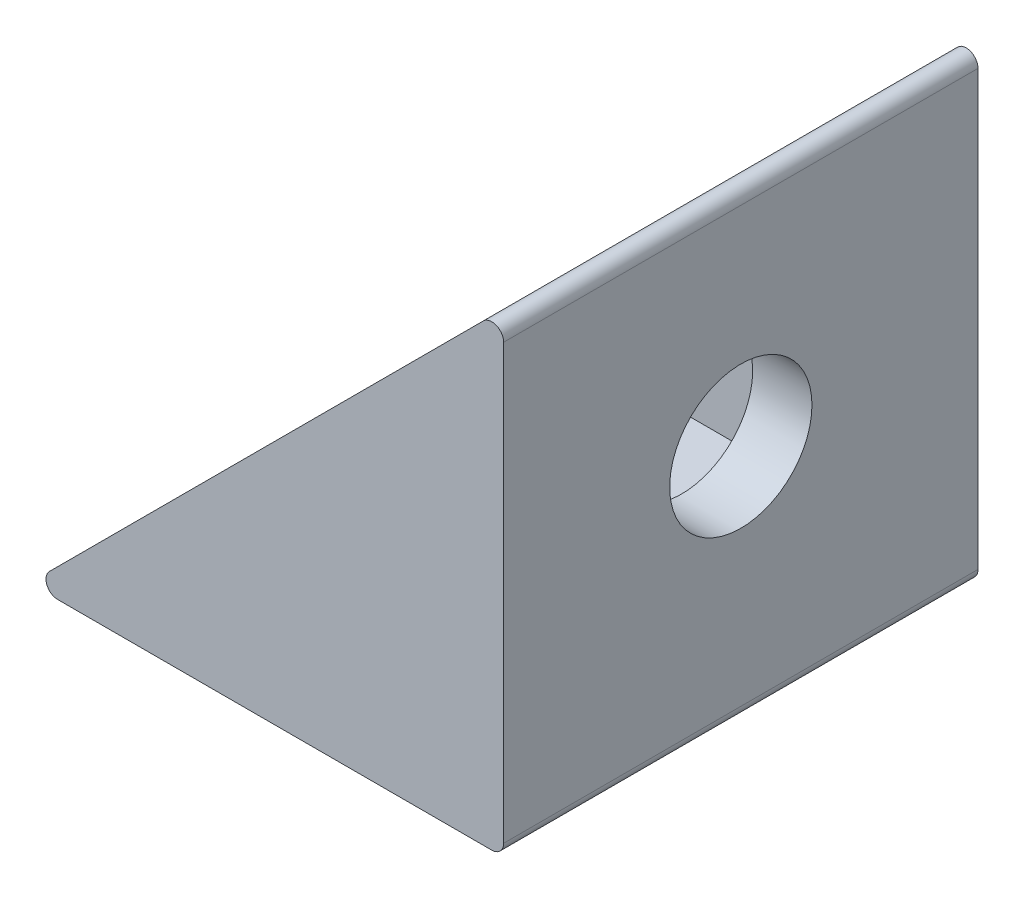
ISO-10303-21;
HEADER;
FILE_DESCRIPTION(('STEP AP214'),'2;1');
FILE_NAME('part.step','',(''),(''),'','','');
FILE_SCHEMA(('AUTOMOTIVE_DESIGN { 1 0 10303 214 1 1 1 1 }'));
ENDSEC;
DATA;
#1=APPLICATION_CONTEXT('core data for automotive mechanical design processes');
#2=APPLICATION_PROTOCOL_DEFINITION('international standard','automotive_design',2000,#1);
#3=PRODUCT_CONTEXT('',#1,'mechanical');
#4=PRODUCT('Part','Part','',(#3));
#5=PRODUCT_RELATED_PRODUCT_CATEGORY('part','',(#4));
#6=PRODUCT_DEFINITION_FORMATION('','',#4);
#7=PRODUCT_DEFINITION_CONTEXT('part definition',#1,'design');
#8=PRODUCT_DEFINITION('design','',#6,#7);
#9=PRODUCT_DEFINITION_SHAPE('','',#8);
#10=(LENGTH_UNIT() NAMED_UNIT(*) SI_UNIT(.MILLI.,.METRE.));
#11=(NAMED_UNIT(*) PLANE_ANGLE_UNIT() SI_UNIT($,.RADIAN.));
#12=(NAMED_UNIT(*) SI_UNIT($,.STERADIAN.) SOLID_ANGLE_UNIT());
#13=UNCERTAINTY_MEASURE_WITH_UNIT(LENGTH_MEASURE(1.E-05),#10,'distance_accuracy_value','');
#14=(GEOMETRIC_REPRESENTATION_CONTEXT(3) GLOBAL_UNCERTAINTY_ASSIGNED_CONTEXT((#13)) GLOBAL_UNIT_ASSIGNED_CONTEXT((#10,
#11,#12)) REPRESENTATION_CONTEXT('',''));
#15=CARTESIAN_POINT('',(0.,0.,0.));
#16=DIRECTION('',(0.,0.,1.));
#17=DIRECTION('',(1.,0.,0.));
#18=AXIS2_PLACEMENT_3D('',#15,#16,#17);
#19=CARTESIAN_POINT('',(0.,20.,0.));
#20=DIRECTION('',(0.,-1.,0.));
#21=DIRECTION('',(0.,0.,-1.));
#22=AXIS2_PLACEMENT_3D('',#19,#20,#21);
#23=CYLINDRICAL_SURFACE('',#22,3.);
#24=CARTESIAN_POINT('',(0.,0.,0.));
#25=DIRECTION('',(0.,-1.,0.));
#26=DIRECTION('',(0.,0.,-1.));
#27=AXIS2_PLACEMENT_3D('',#24,#25,#26);
#28=CIRCLE('',#27,3.);
#29=CARTESIAN_POINT('',(0.,0.,-3.));
#30=VERTEX_POINT('',#29);
#31=EDGE_CURVE('E151',#30,#30,#28,.T.);
#32=ORIENTED_EDGE('',*,*,#31,.T.);
#33=EDGE_LOOP('',(#32));
#34=FACE_BOUND('',#33,.T.);
#35=CARTESIAN_POINT('',(0.,2.5,0.));
#36=DIRECTION('',(0.,1.,0.));
#37=DIRECTION('',(0.,0.,1.));
#38=AXIS2_PLACEMENT_3D('',#35,#36,#37);
#39=CIRCLE('',#38,3.);
#40=CARTESIAN_POINT('',(0.,2.5,3.));
#41=VERTEX_POINT('',#40);
#42=EDGE_CURVE('E127',#41,#41,#39,.F.);
#43=ORIENTED_EDGE('',*,*,#42,.F.);
#44=EDGE_LOOP('',(#43));
#45=FACE_BOUND('',#44,.T.);
#46=ADVANCED_FACE('F41',(#34,#45),#23,.F.);
#47=CARTESIAN_POINT('',(10.,20.,-10.));
#48=DIRECTION('',(-1.,0.,0.));
#49=DIRECTION('',(0.,0.,1.));
#50=AXIS2_PLACEMENT_3D('',#47,#48,#49);
#51=PLANE('',#50);
#52=CARTESIAN_POINT('',(10.,10.,0.));
#53=DIRECTION('',(1.,0.,0.));
#54=DIRECTION('',(0.,0.,-1.));
#55=AXIS2_PLACEMENT_3D('',#52,#53,#54);
#56=CIRCLE('',#55,3.);
#57=CARTESIAN_POINT('',(10.,10.,-3.));
#58=VERTEX_POINT('',#57);
#59=EDGE_CURVE('E156',#58,#58,#56,.T.);
#60=ORIENTED_EDGE('',*,*,#59,.F.);
#61=EDGE_LOOP('',(#60));
#62=FACE_BOUND('',#61,.T.);
#63=DIRECTION('',(0.,-1.,0.));
#64=VECTOR('',#63,1.);
#65=CARTESIAN_POINT('',(10.,20.,10.));
#66=LINE('',#65,#64);
#67=CARTESIAN_POINT('',(10.,18.7928932188134,10.));
#68=VERTEX_POINT('',#67);
#69=CARTESIAN_POINT('',(10.,0.5,10.));
#70=VERTEX_POINT('',#69);
#71=EDGE_CURVE('E175',#68,#70,#66,.T.);
#72=ORIENTED_EDGE('',*,*,#71,.T.);
#73=DIRECTION('',(0.,0.,-1.));
#74=VECTOR('',#73,1.);
#75=CARTESIAN_POINT('',(10.,0.5,-10.));
#76=LINE('',#75,#74);
#77=CARTESIAN_POINT('',(10.,0.5,-10.));
#78=VERTEX_POINT('',#77);
#79=EDGE_CURVE('E198',#70,#78,#76,.T.);
#80=ORIENTED_EDGE('',*,*,#79,.T.);
#81=DIRECTION('',(0.,-1.,0.));
#82=VECTOR('',#81,1.);
#83=CARTESIAN_POINT('',(10.,20.,-10.));
#84=LINE('',#83,#82);
#85=CARTESIAN_POINT('',(10.,18.7928932188134,-10.));
#86=VERTEX_POINT('',#85);
#87=EDGE_CURVE('E179',#86,#78,#84,.T.);
#88=ORIENTED_EDGE('',*,*,#87,.F.);
#89=DIRECTION('',(0.,0.,-1.));
#90=VECTOR('',#89,1.);
#91=CARTESIAN_POINT('',(10.,18.7928932188134,-10.));
#92=LINE('',#91,#90);
#93=EDGE_CURVE('E195',#86,#68,#92,.F.);
#94=ORIENTED_EDGE('',*,*,#93,.T.);
#95=EDGE_LOOP('',(#72,#80,#88,#94));
#96=FACE_BOUND('',#95,.T.);
#97=ADVANCED_FACE('F242',(#62,#96),#51,.F.);
#98=CARTESIAN_POINT('',(-10.,20.,-10.));
#99=DIRECTION('',(0.,0.,1.));
#100=DIRECTION('',(1.,0.,0.));
#101=AXIS2_PLACEMENT_3D('',#98,#99,#100);
#102=PLANE('',#101);
#103=ORIENTED_EDGE('',*,*,#87,.T.);
#104=CARTESIAN_POINT('',(9.5,0.5,-10.));
#105=DIRECTION('',(0.,0.,1.));
#106=DIRECTION('',(1.,0.,0.));
#107=AXIS2_PLACEMENT_3D('',#104,#105,#106);
#108=CIRCLE('',#107,0.5);
#109=CARTESIAN_POINT('',(9.5,0.,-10.));
#110=VERTEX_POINT('',#109);
#111=EDGE_CURVE('E208',#78,#110,#108,.F.);
#112=ORIENTED_EDGE('',*,*,#111,.T.);
#113=DIRECTION('',(-1.,0.,0.));
#114=VECTOR('',#113,1.);
#115=CARTESIAN_POINT('',(-10.,0.,-10.));
#116=LINE('',#115,#114);
#117=CARTESIAN_POINT('',(-8.79289321881345,0.,-10.));
#118=VERTEX_POINT('',#117);
#119=EDGE_CURVE('E167',#110,#118,#116,.T.);
#120=ORIENTED_EDGE('',*,*,#119,.T.);
#121=CARTESIAN_POINT('',(-8.79289321881345,0.5,-10.));
#122=DIRECTION('',(0.,0.,1.));
#123=DIRECTION('',(1.,0.,0.));
#124=AXIS2_PLACEMENT_3D('',#121,#122,#123);
#125=CIRCLE('',#124,0.5);
#126=CARTESIAN_POINT('',(-9.14644660940673,0.853553390593275,-10.));
#127=VERTEX_POINT('',#126);
#128=EDGE_CURVE('E202',#118,#127,#125,.F.);
#129=ORIENTED_EDGE('',*,*,#128,.T.);
#130=DIRECTION('',(0.707106781186548,0.707106781186547,0.));
#131=VECTOR('',#130,1.);
#132=CARTESIAN_POINT('',(-10.,0.,-10.));
#133=LINE('',#132,#131);
#134=CARTESIAN_POINT('',(9.14644660940672,19.1464466094067,-10.));
#135=VERTEX_POINT('',#134);
#136=EDGE_CURVE('E160',#127,#135,#133,.T.);
#137=ORIENTED_EDGE('',*,*,#136,.T.);
#138=CARTESIAN_POINT('',(9.5,18.7928932188134,-10.));
#139=DIRECTION('',(0.,0.,1.));
#140=DIRECTION('',(1.,0.,0.));
#141=AXIS2_PLACEMENT_3D('',#138,#139,#140);
#142=CIRCLE('',#141,0.5);
#143=EDGE_CURVE('E205',#135,#86,#142,.F.);
#144=ORIENTED_EDGE('',*,*,#143,.T.);
#145=EDGE_LOOP('',(#103,#112,#120,#129,#137,#144));
#146=FACE_BOUND('',#145,.T.);
#147=ADVANCED_FACE('F237',(#146),#102,.F.);
#148=CARTESIAN_POINT('',(-10.,20.,10.));
#149=DIRECTION('',(0.,0.,-1.));
#150=DIRECTION('',(-1.,0.,0.));
#151=AXIS2_PLACEMENT_3D('',#148,#149,#150);
#152=PLANE('',#151);
#153=DIRECTION('',(1.,0.,0.));
#154=VECTOR('',#153,1.);
#155=CARTESIAN_POINT('',(-10.,0.,10.));
#156=LINE('',#155,#154);
#157=CARTESIAN_POINT('',(-8.79289321881345,0.,10.));
#158=VERTEX_POINT('',#157);
#159=CARTESIAN_POINT('',(9.5,0.,10.));
#160=VERTEX_POINT('',#159);
#161=EDGE_CURVE('E171',#158,#160,#156,.T.);
#162=ORIENTED_EDGE('',*,*,#161,.T.);
#163=CARTESIAN_POINT('',(9.5,0.5,10.));
#164=DIRECTION('',(0.,0.,-1.));
#165=DIRECTION('',(-1.,0.,0.));
#166=AXIS2_PLACEMENT_3D('',#163,#164,#165);
#167=CIRCLE('',#166,0.5);
#168=EDGE_CURVE('E221',#160,#70,#167,.F.);
#169=ORIENTED_EDGE('',*,*,#168,.T.);
#170=ORIENTED_EDGE('',*,*,#71,.F.);
#171=CARTESIAN_POINT('',(9.5,18.7928932188134,10.));
#172=DIRECTION('',(0.,0.,-1.));
#173=DIRECTION('',(-1.,0.,0.));
#174=AXIS2_PLACEMENT_3D('',#171,#172,#173);
#175=CIRCLE('',#174,0.5);
#176=CARTESIAN_POINT('',(9.14644660940673,19.1464466094067,10.));
#177=VERTEX_POINT('',#176);
#178=EDGE_CURVE('E65',#68,#177,#175,.F.);
#179=ORIENTED_EDGE('',*,*,#178,.T.);
#180=DIRECTION('',(-0.707106781186548,-0.707106781186547,0.));
#181=VECTOR('',#180,1.);
#182=CARTESIAN_POINT('',(0.,10.,10.));
#183=LINE('',#182,#181);
#184=CARTESIAN_POINT('',(-9.14644660940673,0.853553390593275,10.));
#185=VERTEX_POINT('',#184);
#186=EDGE_CURVE('E164',#177,#185,#183,.T.);
#187=ORIENTED_EDGE('',*,*,#186,.T.);
#188=CARTESIAN_POINT('',(-8.79289321881345,0.5,10.));
#189=DIRECTION('',(0.,0.,-1.));
#190=DIRECTION('',(-1.,0.,0.));
#191=AXIS2_PLACEMENT_3D('',#188,#189,#190);
#192=CIRCLE('',#191,0.5);
#193=EDGE_CURVE('E57',#185,#158,#192,.F.);
#194=ORIENTED_EDGE('',*,*,#193,.T.);
#195=EDGE_LOOP('',(#162,#169,#170,#179,#187,#194));
#196=FACE_BOUND('',#195,.T.);
#197=ADVANCED_FACE('F229',(#196),#152,.F.);
#198=CARTESIAN_POINT('',(0.,0.,0.));
#199=DIRECTION('',(0.,1.,0.));
#200=DIRECTION('',(0.,0.,1.));
#201=AXIS2_PLACEMENT_3D('',#198,#199,#200);
#202=PLANE('',#201);
#203=ORIENTED_EDGE('',*,*,#31,.F.);
#204=EDGE_LOOP('',(#203));
#205=FACE_BOUND('',#204,.T.);
#206=ORIENTED_EDGE('',*,*,#119,.F.);
#207=DIRECTION('',(0.,0.,-1.));
#208=VECTOR('',#207,1.);
#209=CARTESIAN_POINT('',(9.5,0.,0.));
#210=LINE('',#209,#208);
#211=EDGE_CURVE('E214',#110,#160,#210,.F.);
#212=ORIENTED_EDGE('',*,*,#211,.T.);
#213=ORIENTED_EDGE('',*,*,#161,.F.);
#214=DIRECTION('',(0.,0.,1.));
#215=VECTOR('',#214,1.);
#216=CARTESIAN_POINT('',(-8.79289321881345,0.,0.));
#217=LINE('',#216,#215);
#218=EDGE_CURVE('E211',#158,#118,#217,.F.);
#219=ORIENTED_EDGE('',*,*,#218,.T.);
#220=EDGE_LOOP('',(#206,#212,#213,#219));
#221=FACE_BOUND('',#220,.T.);
#222=ADVANCED_FACE('F234',(#205,#221),#202,.F.);
#223=CARTESIAN_POINT('',(-10.,0.,-10.));
#224=DIRECTION('',(0.707106781186547,-0.707106781186548,0.));
#225=DIRECTION('',(0.707106781186548,0.707106781186547,0.));
#226=AXIS2_PLACEMENT_3D('',#223,#224,#225);
#227=PLANE('',#226);
#228=DIRECTION('',(0.,0.,1.));
#229=VECTOR('',#228,1.);
#230=CARTESIAN_POINT('',(7.5,17.5,-10.));
#231=LINE('',#230,#229);
#232=CARTESIAN_POINT('',(7.5,17.5,-7.5));
#233=VERTEX_POINT('',#232);
#234=CARTESIAN_POINT('',(7.5,17.5,7.5));
#235=VERTEX_POINT('',#234);
#236=EDGE_CURVE('E141',#233,#235,#231,.T.);
#237=ORIENTED_EDGE('',*,*,#236,.T.);
#238=DIRECTION('',(-0.707106781186548,-0.707106781186547,0.));
#239=VECTOR('',#238,1.);
#240=CARTESIAN_POINT('',(-10.,0.,7.5));
#241=LINE('',#240,#239);
#242=CARTESIAN_POINT('',(-7.5,2.5,7.5));
#243=VERTEX_POINT('',#242);
#244=EDGE_CURVE('E191',#235,#243,#241,.T.);
#245=ORIENTED_EDGE('',*,*,#244,.T.);
#246=DIRECTION('',(0.,0.,-1.));
#247=VECTOR('',#246,1.);
#248=CARTESIAN_POINT('',(-7.5,2.5,7.5));
#249=LINE('',#248,#247);
#250=CARTESIAN_POINT('',(-7.5,2.5,-7.5));
#251=VERTEX_POINT('',#250);
#252=EDGE_CURVE('E146',#243,#251,#249,.T.);
#253=ORIENTED_EDGE('',*,*,#252,.T.);
#254=DIRECTION('',(0.707106781186548,0.707106781186547,0.));
#255=VECTOR('',#254,1.);
#256=CARTESIAN_POINT('',(-10.,0.,-7.5));
#257=LINE('',#256,#255);
#258=EDGE_CURVE('E122',#251,#233,#257,.T.);
#259=ORIENTED_EDGE('',*,*,#258,.T.);
#260=EDGE_LOOP('',(#237,#245,#253,#259));
#261=FACE_BOUND('',#260,.T.);
#262=ORIENTED_EDGE('',*,*,#186,.F.);
#263=DIRECTION('',(0.,0.,-1.));
#264=VECTOR('',#263,1.);
#265=CARTESIAN_POINT('',(9.14644660940672,19.1464466094067,-10.));
#266=LINE('',#265,#264);
#267=EDGE_CURVE('E12',#177,#135,#266,.T.);
#268=ORIENTED_EDGE('',*,*,#267,.T.);
#269=ORIENTED_EDGE('',*,*,#136,.F.);
#270=DIRECTION('',(0.,0.,1.));
#271=VECTOR('',#270,1.);
#272=CARTESIAN_POINT('',(-9.14644660940673,0.853553390593274,-10.));
#273=LINE('',#272,#271);
#274=EDGE_CURVE('E50',#127,#185,#273,.T.);
#275=ORIENTED_EDGE('',*,*,#274,.T.);
#276=EDGE_LOOP('',(#262,#268,#269,#275));
#277=FACE_BOUND('',#276,.T.);
#278=ADVANCED_FACE('F226',(#261,#277),#227,.F.);
#279=CARTESIAN_POINT('',(-10.,10.,0.));
#280=DIRECTION('',(1.,0.,0.));
#281=DIRECTION('',(0.,0.,-1.));
#282=AXIS2_PLACEMENT_3D('',#279,#280,#281);
#283=CYLINDRICAL_SURFACE('',#282,3.);
#284=CARTESIAN_POINT('',(7.5,10.,0.));
#285=DIRECTION('',(1.,0.,0.));
#286=DIRECTION('',(0.,0.,-1.));
#287=AXIS2_PLACEMENT_3D('',#284,#285,#286);
#288=CIRCLE('',#287,3.);
#289=CARTESIAN_POINT('',(7.5,10.,-3.));
#290=VERTEX_POINT('',#289);
#291=EDGE_CURVE('E152',#290,#290,#288,.F.);
#292=ORIENTED_EDGE('',*,*,#291,.T.);
#293=EDGE_LOOP('',(#292));
#294=FACE_BOUND('',#293,.T.);
#295=ORIENTED_EDGE('',*,*,#59,.T.);
#296=EDGE_LOOP('',(#295));
#297=FACE_BOUND('',#296,.T.);
#298=ADVANCED_FACE('F265',(#294,#297),#283,.F.);
#299=CARTESIAN_POINT('',(-7.5,-21.2132034355964,7.5));
#300=DIRECTION('',(0.,0.,1.));
#301=DIRECTION('',(1.,0.,0.));
#302=AXIS2_PLACEMENT_3D('',#299,#300,#301);
#303=PLANE('',#302);
#304=DIRECTION('',(0.,1.,0.));
#305=VECTOR('',#304,1.);
#306=CARTESIAN_POINT('',(7.5,-21.2132034355964,7.5));
#307=LINE('',#306,#305);
#308=CARTESIAN_POINT('',(7.5,2.5,7.5));
#309=VERTEX_POINT('',#308);
#310=EDGE_CURVE('E143',#309,#235,#307,.T.);
#311=ORIENTED_EDGE('',*,*,#310,.F.);
#312=DIRECTION('',(-1.,0.,0.));
#313=VECTOR('',#312,1.);
#314=CARTESIAN_POINT('',(-7.5,2.5,7.5));
#315=LINE('',#314,#313);
#316=EDGE_CURVE('E133',#309,#243,#315,.T.);
#317=ORIENTED_EDGE('',*,*,#316,.T.);
#318=ORIENTED_EDGE('',*,*,#244,.F.);
#319=EDGE_LOOP('',(#311,#317,#318));
#320=FACE_BOUND('',#319,.T.);
#321=ADVANCED_FACE('F268',(#320),#303,.F.);
#322=CARTESIAN_POINT('',(-7.5,-21.2132034355964,-7.5));
#323=DIRECTION('',(0.,0.,-1.));
#324=DIRECTION('',(-1.,0.,0.));
#325=AXIS2_PLACEMENT_3D('',#322,#323,#324);
#326=PLANE('',#325);
#327=DIRECTION('',(1.,0.,0.));
#328=VECTOR('',#327,1.);
#329=CARTESIAN_POINT('',(-7.5,2.5,-7.5));
#330=LINE('',#329,#328);
#331=CARTESIAN_POINT('',(7.5,2.5,-7.5));
#332=VERTEX_POINT('',#331);
#333=EDGE_CURVE('E116',#251,#332,#330,.T.);
#334=ORIENTED_EDGE('',*,*,#333,.T.);
#335=DIRECTION('',(0.,1.,0.));
#336=VECTOR('',#335,1.);
#337=CARTESIAN_POINT('',(7.5,-21.2132034355964,-7.5));
#338=LINE('',#337,#336);
#339=EDGE_CURVE('E120',#332,#233,#338,.T.);
#340=ORIENTED_EDGE('',*,*,#339,.T.);
#341=ORIENTED_EDGE('',*,*,#258,.F.);
#342=EDGE_LOOP('',(#334,#340,#341));
#343=FACE_BOUND('',#342,.T.);
#344=ADVANCED_FACE('F118',(#343),#326,.F.);
#345=CARTESIAN_POINT('',(7.5,-21.2132034355964,7.5));
#346=DIRECTION('',(1.,0.,0.));
#347=DIRECTION('',(0.,0.,-1.));
#348=AXIS2_PLACEMENT_3D('',#345,#346,#347);
#349=PLANE('',#348);
#350=ORIENTED_EDGE('',*,*,#291,.F.);
#351=EDGE_LOOP('',(#350));
#352=FACE_BOUND('',#351,.T.);
#353=ORIENTED_EDGE('',*,*,#339,.F.);
#354=DIRECTION('',(0.,0.,1.));
#355=VECTOR('',#354,1.);
#356=CARTESIAN_POINT('',(7.5,2.5,7.5));
#357=LINE('',#356,#355);
#358=EDGE_CURVE('E128',#332,#309,#357,.T.);
#359=ORIENTED_EDGE('',*,*,#358,.T.);
#360=ORIENTED_EDGE('',*,*,#310,.T.);
#361=ORIENTED_EDGE('',*,*,#236,.F.);
#362=EDGE_LOOP('',(#353,#359,#360,#361));
#363=FACE_BOUND('',#362,.T.);
#364=ADVANCED_FACE('F139',(#352,#363),#349,.F.);
#365=CARTESIAN_POINT('',(0.,2.5,0.));
#366=DIRECTION('',(0.,1.,0.));
#367=DIRECTION('',(0.,0.,1.));
#368=AXIS2_PLACEMENT_3D('',#365,#366,#367);
#369=PLANE('',#368);
#370=ORIENTED_EDGE('',*,*,#358,.F.);
#371=ORIENTED_EDGE('',*,*,#333,.F.);
#372=ORIENTED_EDGE('',*,*,#252,.F.);
#373=ORIENTED_EDGE('',*,*,#316,.F.);
#374=EDGE_LOOP('',(#370,#371,#372,#373));
#375=FACE_BOUND('',#374,.T.);
#376=ORIENTED_EDGE('',*,*,#42,.T.);
#377=EDGE_LOOP('',(#376));
#378=FACE_BOUND('',#377,.T.);
#379=ADVANCED_FACE('F131',(#375,#378),#369,.T.);
#380=CARTESIAN_POINT('',(9.5,0.5,-10.));
#381=DIRECTION('',(0.,0.,-1.));
#382=DIRECTION('',(-1.,0.,0.));
#383=AXIS2_PLACEMENT_3D('',#380,#381,#382);
#384=CYLINDRICAL_SURFACE('',#383,0.5);
#385=ORIENTED_EDGE('',*,*,#168,.F.);
#386=ORIENTED_EDGE('',*,*,#211,.F.);
#387=ORIENTED_EDGE('',*,*,#111,.F.);
#388=ORIENTED_EDGE('',*,*,#79,.F.);
#389=EDGE_LOOP('',(#385,#386,#387,#388));
#390=FACE_BOUND('',#389,.T.);
#391=ADVANCED_FACE('F239',(#390),#384,.T.);
#392=CARTESIAN_POINT('',(9.5,18.7928932188134,-10.));
#393=DIRECTION('',(0.,0.,-1.));
#394=DIRECTION('',(-1.,0.,0.));
#395=AXIS2_PLACEMENT_3D('',#392,#393,#394);
#396=CYLINDRICAL_SURFACE('',#395,0.5);
#397=ORIENTED_EDGE('',*,*,#178,.F.);
#398=ORIENTED_EDGE('',*,*,#93,.F.);
#399=ORIENTED_EDGE('',*,*,#143,.F.);
#400=ORIENTED_EDGE('',*,*,#267,.F.);
#401=EDGE_LOOP('',(#397,#398,#399,#400));
#402=FACE_BOUND('',#401,.T.);
#403=ADVANCED_FACE('F246',(#402),#396,.T.);
#404=CARTESIAN_POINT('',(-8.79289321881345,0.5,-10.));
#405=DIRECTION('',(0.,0.,1.));
#406=DIRECTION('',(1.,0.,0.));
#407=AXIS2_PLACEMENT_3D('',#404,#405,#406);
#408=CYLINDRICAL_SURFACE('',#407,0.5);
#409=ORIENTED_EDGE('',*,*,#128,.F.);
#410=ORIENTED_EDGE('',*,*,#218,.F.);
#411=ORIENTED_EDGE('',*,*,#193,.F.);
#412=ORIENTED_EDGE('',*,*,#274,.F.);
#413=EDGE_LOOP('',(#409,#410,#411,#412));
#414=FACE_BOUND('',#413,.T.);
#415=ADVANCED_FACE('F43',(#414),#408,.T.);
#416=CLOSED_SHELL('',(#46,#97,#147,#197,#222,#278,#298,#321,#344,#364,#379,#391,#403,#415));
#417=MANIFOLD_SOLID_BREP('B2',#416);
#418=ADVANCED_BREP_SHAPE_REPRESENTATION('',(#18,#417),#14);
#419=SHAPE_DEFINITION_REPRESENTATION(#9,#418);
ENDSEC;
END-ISO-10303-21;
